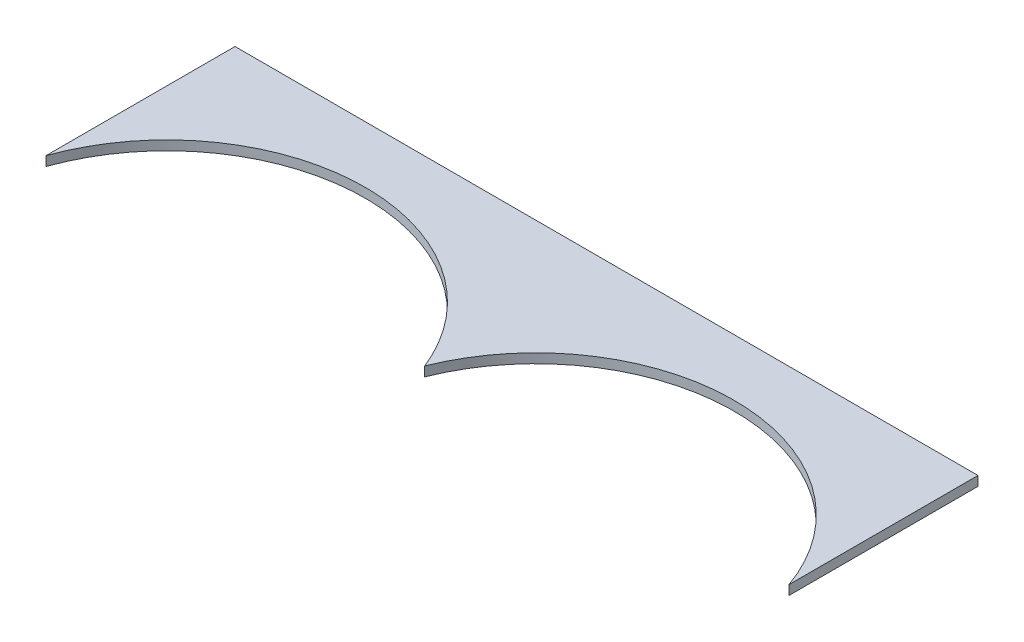
ISO-10303-21;
HEADER;
FILE_DESCRIPTION(('STEP AP214'),'2;1');
FILE_NAME('part.step','',(''),(''),'','','');
FILE_SCHEMA(('AUTOMOTIVE_DESIGN { 1 0 10303 214 1 1 1 1 }'));
ENDSEC;
DATA;
#1=APPLICATION_CONTEXT('core data for automotive mechanical design processes');
#2=APPLICATION_PROTOCOL_DEFINITION('international standard','automotive_design',2000,#1);
#3=PRODUCT_CONTEXT('',#1,'mechanical');
#4=PRODUCT('Part','Part','',(#3));
#5=PRODUCT_RELATED_PRODUCT_CATEGORY('part','',(#4));
#6=PRODUCT_DEFINITION_FORMATION('','',#4);
#7=PRODUCT_DEFINITION_CONTEXT('part definition',#1,'design');
#8=PRODUCT_DEFINITION('design','',#6,#7);
#9=PRODUCT_DEFINITION_SHAPE('','',#8);
#10=(LENGTH_UNIT() NAMED_UNIT(*) SI_UNIT(.MILLI.,.METRE.));
#11=(NAMED_UNIT(*) PLANE_ANGLE_UNIT() SI_UNIT($,.RADIAN.));
#12=(NAMED_UNIT(*) SI_UNIT($,.STERADIAN.) SOLID_ANGLE_UNIT());
#13=UNCERTAINTY_MEASURE_WITH_UNIT(LENGTH_MEASURE(1.E-05),#10,'distance_accuracy_value','');
#14=(GEOMETRIC_REPRESENTATION_CONTEXT(3) GLOBAL_UNCERTAINTY_ASSIGNED_CONTEXT((#13)) GLOBAL_UNIT_ASSIGNED_CONTEXT((#10,
#11,#12)) REPRESENTATION_CONTEXT('',''));
#15=CARTESIAN_POINT('',(0.,0.,0.));
#16=DIRECTION('',(0.,0.,1.));
#17=DIRECTION('',(1.,0.,0.));
#18=AXIS2_PLACEMENT_3D('',#15,#16,#17);
#19=CARTESIAN_POINT('',(-72.2115036396196,2.,-21.3275053008329));
#20=DIRECTION('',(1.,0.,0.));
#21=DIRECTION('',(0.,0.,-1.));
#22=AXIS2_PLACEMENT_3D('',#19,#20,#21);
#23=PLANE('',#22);
#24=DIRECTION('',(0.,0.,1.));
#25=VECTOR('',#24,1.);
#26=CARTESIAN_POINT('',(-72.2115036396196,0.,-21.3275053008329));
#27=LINE('',#26,#25);
#28=CARTESIAN_POINT('',(-72.2115036396196,0.,-21.3275053008329));
#29=VERTEX_POINT('',#28);
#30=CARTESIAN_POINT('',(-72.2115036396196,0.,18.6724946991671));
#31=VERTEX_POINT('',#30);
#32=EDGE_CURVE('E107',#29,#31,#27,.T.);
#33=ORIENTED_EDGE('',*,*,#32,.T.);
#34=DIRECTION('',(0.,-1.,0.));
#35=VECTOR('',#34,1.);
#36=CARTESIAN_POINT('',(-72.2115036396196,2.,18.6724946991671));
#37=LINE('',#36,#35);
#38=CARTESIAN_POINT('',(-72.2115036396196,2.,18.6724946991671));
#39=VERTEX_POINT('',#38);
#40=EDGE_CURVE('E11',#39,#31,#37,.T.);
#41=ORIENTED_EDGE('',*,*,#40,.F.);
#42=DIRECTION('',(0.,0.,1.));
#43=VECTOR('',#42,1.);
#44=CARTESIAN_POINT('',(-72.2115036396196,2.,-21.3275053008329));
#45=LINE('',#44,#43);
#46=CARTESIAN_POINT('',(-72.2115036396196,2.,-21.3275053008329));
#47=VERTEX_POINT('',#46);
#48=EDGE_CURVE('E115',#47,#39,#45,.T.);
#49=ORIENTED_EDGE('',*,*,#48,.F.);
#50=DIRECTION('',(0.,-1.,0.));
#51=VECTOR('',#50,1.);
#52=CARTESIAN_POINT('',(-72.2115036396196,2.,-21.3275053008329));
#53=LINE('',#52,#51);
#54=EDGE_CURVE('E103',#47,#29,#53,.T.);
#55=ORIENTED_EDGE('',*,*,#54,.T.);
#56=EDGE_LOOP('',(#33,#41,#49,#55));
#57=FACE_BOUND('',#56,.T.);
#58=ADVANCED_FACE('F33',(#57),#23,.F.);
#59=CARTESIAN_POINT('',(-32.6210418260624,2.,32.6937404850903));
#60=DIRECTION('',(0.,-1.,0.));
#61=DIRECTION('',(0.,0.,-1.));
#62=AXIS2_PLACEMENT_3D('',#59,#60,#61);
#63=CYLINDRICAL_SURFACE('',#62,42.);
#64=CARTESIAN_POINT('',(-32.6210418260624,0.,32.6937404850903));
#65=DIRECTION('',(0.,-1.,0.));
#66=DIRECTION('',(0.,0.,-1.));
#67=AXIS2_PLACEMENT_3D('',#64,#65,#66);
#68=CIRCLE('',#67,42.);
#69=CARTESIAN_POINT('',(6.40388023612135,0.,17.1677797083626));
#70=VERTEX_POINT('',#69);
#71=EDGE_CURVE('E110',#31,#70,#68,.T.);
#72=ORIENTED_EDGE('',*,*,#71,.T.);
#73=DIRECTION('',(0.,-1.,0.));
#74=VECTOR('',#73,1.);
#75=CARTESIAN_POINT('',(6.40388023612135,2.,17.1677797083626));
#76=LINE('',#75,#74);
#77=CARTESIAN_POINT('',(6.40388023612135,2.,17.1677797083626));
#78=VERTEX_POINT('',#77);
#79=EDGE_CURVE('E41',#78,#70,#76,.T.);
#80=ORIENTED_EDGE('',*,*,#79,.F.);
#81=CARTESIAN_POINT('',(-32.6210418260624,2.,32.6937404850903));
#82=DIRECTION('',(0.,-1.,0.));
#83=DIRECTION('',(0.,0.,-1.));
#84=AXIS2_PLACEMENT_3D('',#81,#82,#83);
#85=CIRCLE('',#84,42.);
#86=EDGE_CURVE('E83',#39,#78,#85,.T.);
#87=ORIENTED_EDGE('',*,*,#86,.F.);
#88=ORIENTED_EDGE('',*,*,#40,.T.);
#89=EDGE_LOOP('',(#72,#80,#87,#88));
#90=FACE_BOUND('',#89,.T.);
#91=ADVANCED_FACE('F134',(#90),#63,.F.);
#92=CARTESIAN_POINT('',(45.4288022983051,2.,32.6937404850903));
#93=DIRECTION('',(0.,-1.,0.));
#94=DIRECTION('',(0.,0.,-1.));
#95=AXIS2_PLACEMENT_3D('',#92,#93,#94);
#96=CYLINDRICAL_SURFACE('',#95,42.);
#97=CARTESIAN_POINT('',(45.4288022983051,0.,32.6937404850903));
#98=DIRECTION('',(0.,-1.,0.));
#99=DIRECTION('',(0.,0.,-1.));
#100=AXIS2_PLACEMENT_3D('',#97,#98,#99);
#101=CIRCLE('',#100,42.);
#102=CARTESIAN_POINT('',(85.0192641118623,0.,18.6724946991671));
#103=VERTEX_POINT('',#102);
#104=EDGE_CURVE('E98',#70,#103,#101,.T.);
#105=ORIENTED_EDGE('',*,*,#104,.T.);
#106=DIRECTION('',(0.,-1.,0.));
#107=VECTOR('',#106,1.);
#108=CARTESIAN_POINT('',(85.0192641118623,2.,18.6724946991671));
#109=LINE('',#108,#107);
#110=CARTESIAN_POINT('',(85.0192641118623,2.,18.6724946991671));
#111=VERTEX_POINT('',#110);
#112=EDGE_CURVE('E95',#111,#103,#109,.T.);
#113=ORIENTED_EDGE('',*,*,#112,.F.);
#114=CARTESIAN_POINT('',(45.4288022983051,2.,32.6937404850903));
#115=DIRECTION('',(0.,-1.,0.));
#116=DIRECTION('',(0.,0.,-1.));
#117=AXIS2_PLACEMENT_3D('',#114,#115,#116);
#118=CIRCLE('',#117,42.);
#119=EDGE_CURVE('E87',#78,#111,#118,.T.);
#120=ORIENTED_EDGE('',*,*,#119,.F.);
#121=ORIENTED_EDGE('',*,*,#79,.T.);
#122=EDGE_LOOP('',(#105,#113,#120,#121));
#123=FACE_BOUND('',#122,.T.);
#124=ADVANCED_FACE('F96',(#123),#96,.F.);
#125=CARTESIAN_POINT('',(85.0192641118623,2.,-21.3275053008329));
#126=DIRECTION('',(-1.,0.,0.));
#127=DIRECTION('',(0.,0.,1.));
#128=AXIS2_PLACEMENT_3D('',#125,#126,#127);
#129=PLANE('',#128);
#130=DIRECTION('',(0.,0.,-1.));
#131=VECTOR('',#130,1.);
#132=CARTESIAN_POINT('',(85.0192641118623,0.,-21.3275053008329));
#133=LINE('',#132,#131);
#134=CARTESIAN_POINT('',(85.0192641118623,0.,-21.3275053008329));
#135=VERTEX_POINT('',#134);
#136=EDGE_CURVE('E69',#103,#135,#133,.T.);
#137=ORIENTED_EDGE('',*,*,#136,.T.);
#138=DIRECTION('',(0.,-1.,0.));
#139=VECTOR('',#138,1.);
#140=CARTESIAN_POINT('',(85.0192641118623,2.,-21.3275053008329));
#141=LINE('',#140,#139);
#142=CARTESIAN_POINT('',(85.0192641118623,2.,-21.3275053008329));
#143=VERTEX_POINT('',#142);
#144=EDGE_CURVE('E99',#143,#135,#141,.T.);
#145=ORIENTED_EDGE('',*,*,#144,.F.);
#146=DIRECTION('',(0.,0.,-1.));
#147=VECTOR('',#146,1.);
#148=CARTESIAN_POINT('',(85.0192641118623,2.,-21.3275053008329));
#149=LINE('',#148,#147);
#150=EDGE_CURVE('E91',#111,#143,#149,.T.);
#151=ORIENTED_EDGE('',*,*,#150,.F.);
#152=ORIENTED_EDGE('',*,*,#112,.T.);
#153=EDGE_LOOP('',(#137,#145,#151,#152));
#154=FACE_BOUND('',#153,.T.);
#155=ADVANCED_FACE('F101',(#154),#129,.F.);
#156=CARTESIAN_POINT('',(-72.2115036396196,2.,-21.3275053008329));
#157=DIRECTION('',(0.,0.,1.));
#158=DIRECTION('',(1.,0.,0.));
#159=AXIS2_PLACEMENT_3D('',#156,#157,#158);
#160=PLANE('',#159);
#161=DIRECTION('',(-1.,0.,0.));
#162=VECTOR('',#161,1.);
#163=CARTESIAN_POINT('',(-72.2115036396196,0.,-21.3275053008329));
#164=LINE('',#163,#162);
#165=EDGE_CURVE('E75',#135,#29,#164,.T.);
#166=ORIENTED_EDGE('',*,*,#165,.T.);
#167=ORIENTED_EDGE('',*,*,#54,.F.);
#168=DIRECTION('',(-1.,0.,0.));
#169=VECTOR('',#168,1.);
#170=CARTESIAN_POINT('',(-72.2115036396196,2.,-21.3275053008329));
#171=LINE('',#170,#169);
#172=EDGE_CURVE('E49',#143,#47,#171,.T.);
#173=ORIENTED_EDGE('',*,*,#172,.F.);
#174=ORIENTED_EDGE('',*,*,#144,.T.);
#175=EDGE_LOOP('',(#166,#167,#173,#174));
#176=FACE_BOUND('',#175,.T.);
#177=ADVANCED_FACE('F123',(#176),#160,.F.);
#178=CARTESIAN_POINT('',(-32.6210418260624,2.,32.6937404850903));
#179=DIRECTION('',(0.,-1.,0.));
#180=DIRECTION('',(0.,0.,-1.));
#181=AXIS2_PLACEMENT_3D('',#178,#179,#180);
#182=PLANE('',#181);
#183=ORIENTED_EDGE('',*,*,#48,.T.);
#184=ORIENTED_EDGE('',*,*,#86,.T.);
#185=ORIENTED_EDGE('',*,*,#119,.T.);
#186=ORIENTED_EDGE('',*,*,#150,.T.);
#187=ORIENTED_EDGE('',*,*,#172,.T.);
#188=EDGE_LOOP('',(#183,#184,#185,#186,#187));
#189=FACE_BOUND('',#188,.T.);
#190=ADVANCED_FACE('F89',(#189),#182,.F.);
#191=CARTESIAN_POINT('',(-32.6210418260624,0.,32.6937404850903));
#192=DIRECTION('',(0.,-1.,0.));
#193=DIRECTION('',(0.,0.,-1.));
#194=AXIS2_PLACEMENT_3D('',#191,#192,#193);
#195=PLANE('',#194);
#196=ORIENTED_EDGE('',*,*,#32,.F.);
#197=ORIENTED_EDGE('',*,*,#165,.F.);
#198=ORIENTED_EDGE('',*,*,#136,.F.);
#199=ORIENTED_EDGE('',*,*,#104,.F.);
#200=ORIENTED_EDGE('',*,*,#71,.F.);
#201=EDGE_LOOP('',(#196,#197,#198,#199,#200));
#202=FACE_BOUND('',#201,.T.);
#203=ADVANCED_FACE('F119',(#202),#195,.T.);
#204=CLOSED_SHELL('',(#58,#91,#124,#155,#177,#190,#203));
#205=MANIFOLD_SOLID_BREP('B2',#204);
#206=ADVANCED_BREP_SHAPE_REPRESENTATION('',(#18,#205),#14);
#207=SHAPE_DEFINITION_REPRESENTATION(#9,#206);
ENDSEC;
END-ISO-10303-21;
